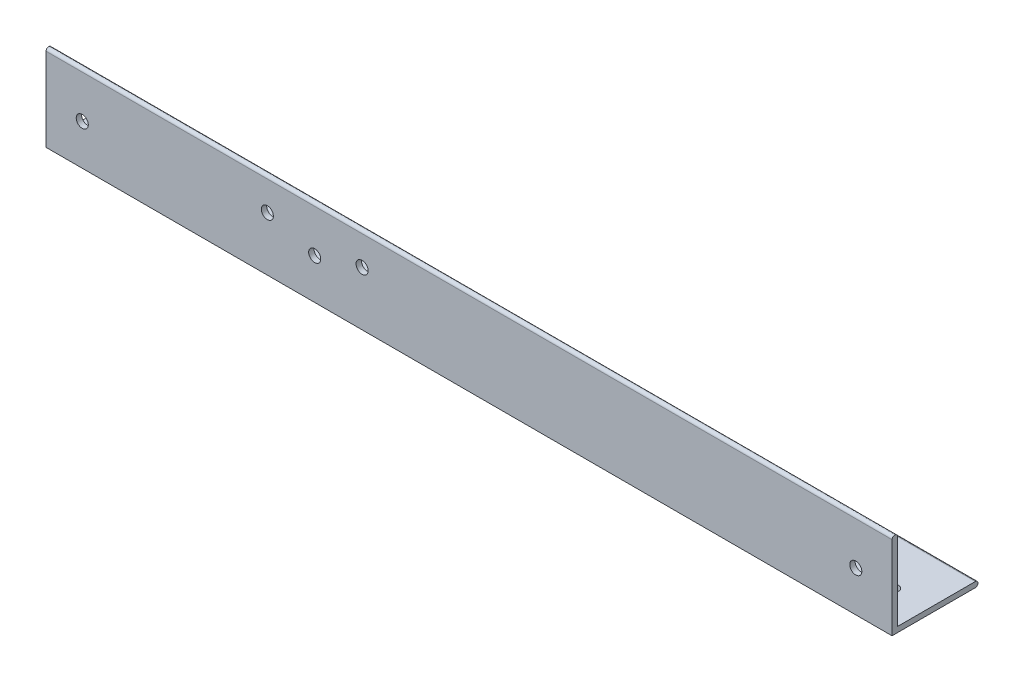
ISO-10303-21;
HEADER;
FILE_DESCRIPTION(('STEP AP214'),'2;1');
FILE_NAME('part.step','',(''),(''),'','','');
FILE_SCHEMA(('AUTOMOTIVE_DESIGN { 1 0 10303 214 1 1 1 1 }'));
ENDSEC;
DATA;
#1=APPLICATION_CONTEXT('core data for automotive mechanical design processes');
#2=APPLICATION_PROTOCOL_DEFINITION('international standard','automotive_design',2000,#1);
#3=PRODUCT_CONTEXT('',#1,'mechanical');
#4=PRODUCT('Part','Part','',(#3));
#5=PRODUCT_RELATED_PRODUCT_CATEGORY('part','',(#4));
#6=PRODUCT_DEFINITION_FORMATION('','',#4);
#7=PRODUCT_DEFINITION_CONTEXT('part definition',#1,'design');
#8=PRODUCT_DEFINITION('design','',#6,#7);
#9=PRODUCT_DEFINITION_SHAPE('','',#8);
#10=(LENGTH_UNIT() NAMED_UNIT(*) SI_UNIT(.MILLI.,.METRE.));
#11=(NAMED_UNIT(*) PLANE_ANGLE_UNIT() SI_UNIT($,.RADIAN.));
#12=(NAMED_UNIT(*) SI_UNIT($,.STERADIAN.) SOLID_ANGLE_UNIT());
#13=UNCERTAINTY_MEASURE_WITH_UNIT(LENGTH_MEASURE(1.E-05),#10,'distance_accuracy_value','');
#14=(GEOMETRIC_REPRESENTATION_CONTEXT(3) GLOBAL_UNCERTAINTY_ASSIGNED_CONTEXT((#13)) GLOBAL_UNIT_ASSIGNED_CONTEXT((#10,
#11,#12)) REPRESENTATION_CONTEXT('',''));
#15=CARTESIAN_POINT('',(0.,0.,0.));
#16=DIRECTION('',(0.,0.,1.));
#17=DIRECTION('',(1.,0.,0.));
#18=AXIS2_PLACEMENT_3D('',#15,#16,#17);
#19=CARTESIAN_POINT('',(250.,0.793749999999999,-24.60625));
#20=DIRECTION('',(-1.,0.,0.));
#21=DIRECTION('',(0.,0.,1.));
#22=AXIS2_PLACEMENT_3D('',#19,#20,#21);
#23=CYLINDRICAL_SURFACE('',#22,0.793749999999999);
#24=DIRECTION('',(-1.,0.,0.));
#25=VECTOR('',#24,1.);
#26=CARTESIAN_POINT('',(250.,1.5875,-24.60625));
#27=LINE('',#26,#25);
#28=CARTESIAN_POINT('',(250.,1.5875,-24.60625));
#29=VERTEX_POINT('',#28);
#30=CARTESIAN_POINT('',(0.,1.5875,-24.60625));
#31=VERTEX_POINT('',#30);
#32=EDGE_CURVE('E156',#29,#31,#27,.T.);
#33=ORIENTED_EDGE('',*,*,#32,.F.);
#34=CARTESIAN_POINT('',(250.,0.793749999999999,-24.60625));
#35=DIRECTION('',(-1.,0.,0.));
#36=DIRECTION('',(0.,0.,1.));
#37=AXIS2_PLACEMENT_3D('',#34,#35,#36);
#38=CIRCLE('',#37,0.793749999999999);
#39=CARTESIAN_POINT('',(250.,0.,-24.60625));
#40=VERTEX_POINT('',#39);
#41=EDGE_CURVE('E52',#40,#29,#38,.F.);
#42=ORIENTED_EDGE('',*,*,#41,.F.);
#43=DIRECTION('',(-1.,0.,0.));
#44=VECTOR('',#43,1.);
#45=CARTESIAN_POINT('',(250.,0.,-24.60625));
#46=LINE('',#45,#44);
#47=CARTESIAN_POINT('',(0.,0.,-24.60625));
#48=VERTEX_POINT('',#47);
#49=EDGE_CURVE('E159',#48,#40,#46,.F.);
#50=ORIENTED_EDGE('',*,*,#49,.F.);
#51=CARTESIAN_POINT('',(0.,0.793749999999999,-24.60625));
#52=DIRECTION('',(-1.,0.,0.));
#53=DIRECTION('',(0.,0.,1.));
#54=AXIS2_PLACEMENT_3D('',#51,#52,#53);
#55=CIRCLE('',#54,0.793749999999999);
#56=EDGE_CURVE('E11',#31,#48,#55,.T.);
#57=ORIENTED_EDGE('',*,*,#56,.F.);
#58=EDGE_LOOP('',(#33,#42,#50,#57));
#59=FACE_BOUND('',#58,.T.);
#60=ADVANCED_FACE('F42',(#59),#23,.T.);
#61=CARTESIAN_POINT('',(250.,24.60625,-0.79375));
#62=DIRECTION('',(-1.,0.,0.));
#63=DIRECTION('',(0.,0.,1.));
#64=AXIS2_PLACEMENT_3D('',#61,#62,#63);
#65=CYLINDRICAL_SURFACE('',#64,0.79375);
#66=DIRECTION('',(-1.,0.,0.));
#67=VECTOR('',#66,1.);
#68=CARTESIAN_POINT('',(250.,24.60625,0.));
#69=LINE('',#68,#67);
#70=CARTESIAN_POINT('',(250.,24.60625,0.));
#71=VERTEX_POINT('',#70);
#72=CARTESIAN_POINT('',(0.,24.60625,0.));
#73=VERTEX_POINT('',#72);
#74=EDGE_CURVE('E115',#71,#73,#69,.T.);
#75=ORIENTED_EDGE('',*,*,#74,.F.);
#76=CARTESIAN_POINT('',(250.,24.60625,-0.79375));
#77=DIRECTION('',(-1.,0.,0.));
#78=DIRECTION('',(0.,0.,1.));
#79=AXIS2_PLACEMENT_3D('',#76,#77,#78);
#80=CIRCLE('',#79,0.79375);
#81=CARTESIAN_POINT('',(250.,24.60625,-1.5875));
#82=VERTEX_POINT('',#81);
#83=EDGE_CURVE('E150',#82,#71,#80,.F.);
#84=ORIENTED_EDGE('',*,*,#83,.F.);
#85=DIRECTION('',(-1.,0.,0.));
#86=VECTOR('',#85,1.);
#87=CARTESIAN_POINT('',(250.,24.60625,-1.5875));
#88=LINE('',#87,#86);
#89=CARTESIAN_POINT('',(0.,24.60625,-1.5875));
#90=VERTEX_POINT('',#89);
#91=EDGE_CURVE('E121',#90,#82,#88,.F.);
#92=ORIENTED_EDGE('',*,*,#91,.F.);
#93=CARTESIAN_POINT('',(0.,24.60625,-0.79375));
#94=DIRECTION('',(-1.,0.,0.));
#95=DIRECTION('',(0.,0.,1.));
#96=AXIS2_PLACEMENT_3D('',#93,#94,#95);
#97=CIRCLE('',#96,0.79375);
#98=EDGE_CURVE('E153',#73,#90,#97,.T.);
#99=ORIENTED_EDGE('',*,*,#98,.F.);
#100=EDGE_LOOP('',(#75,#84,#92,#99));
#101=FACE_BOUND('',#100,.T.);
#102=ADVANCED_FACE('F203',(#101),#65,.T.);
#103=CARTESIAN_POINT('',(250.,0.,-25.4));
#104=DIRECTION('',(0.,1.,0.));
#105=DIRECTION('',(0.,0.,1.));
#106=AXIS2_PLACEMENT_3D('',#103,#104,#105);
#107=PLANE('',#106);
#108=CARTESIAN_POINT('',(166.52,0.,-10.7199999999997));
#109=DIRECTION('',(0.,-1.,0.));
#110=DIRECTION('',(1.,0.,0.));
#111=AXIS2_PLACEMENT_3D('',#108,#109,#110);
#112=CIRCLE('',#111,2.38000000000001);
#113=CARTESIAN_POINT('',(168.9,0.,-10.7199999999997));
#114=VERTEX_POINT('',#113);
#115=EDGE_CURVE('E351',#114,#114,#112,.T.);
#116=ORIENTED_EDGE('',*,*,#115,.F.);
#117=EDGE_LOOP('',(#116));
#118=FACE_BOUND('',#117,.T.);
#119=CARTESIAN_POINT('',(239.59,0.,-10.723125));
#120=DIRECTION('',(0.,-1.,0.));
#121=DIRECTION('',(0.,0.,-1.));
#122=AXIS2_PLACEMENT_3D('',#119,#120,#121);
#123=CIRCLE('',#122,1.58749999999999);
#124=CARTESIAN_POINT('',(239.59,0.,-12.310625));
#125=VERTEX_POINT('',#124);
#126=EDGE_CURVE('E168',#125,#125,#123,.T.);
#127=ORIENTED_EDGE('',*,*,#126,.F.);
#128=EDGE_LOOP('',(#127));
#129=FACE_BOUND('',#128,.T.);
#130=CARTESIAN_POINT('',(10.41,0.,-10.723125));
#131=DIRECTION('',(0.,-1.,0.));
#132=DIRECTION('',(0.,0.,1.));
#133=AXIS2_PLACEMENT_3D('',#130,#131,#132);
#134=CIRCLE('',#133,1.58749999999998);
#135=CARTESIAN_POINT('',(10.41,0.,-9.13562500000002));
#136=VERTEX_POINT('',#135);
#137=EDGE_CURVE('E185',#136,#136,#134,.T.);
#138=ORIENTED_EDGE('',*,*,#137,.F.);
#139=EDGE_LOOP('',(#138));
#140=FACE_BOUND('',#139,.T.);
#141=DIRECTION('',(0.,0.,-1.));
#142=VECTOR('',#141,1.);
#143=CARTESIAN_POINT('',(0.,0.,-25.4));
#144=LINE('',#143,#142);
#145=CARTESIAN_POINT('',(0.,0.,0.));
#146=VERTEX_POINT('',#145);
#147=EDGE_CURVE('E129',#146,#48,#144,.T.);
#148=ORIENTED_EDGE('',*,*,#147,.T.);
#149=ORIENTED_EDGE('',*,*,#49,.T.);
#150=DIRECTION('',(0.,0.,-1.));
#151=VECTOR('',#150,1.);
#152=CARTESIAN_POINT('',(250.,0.,-25.4));
#153=LINE('',#152,#151);
#154=CARTESIAN_POINT('',(250.,0.,0.));
#155=VERTEX_POINT('',#154);
#156=EDGE_CURVE('E105',#155,#40,#153,.T.);
#157=ORIENTED_EDGE('',*,*,#156,.F.);
#158=DIRECTION('',(-1.,0.,0.));
#159=VECTOR('',#158,1.);
#160=CARTESIAN_POINT('',(250.,0.,0.));
#161=LINE('',#160,#159);
#162=EDGE_CURVE('E116',#155,#146,#161,.T.);
#163=ORIENTED_EDGE('',*,*,#162,.T.);
#164=EDGE_LOOP('',(#148,#149,#157,#163));
#165=FACE_BOUND('',#164,.T.);
#166=ADVANCED_FACE('F198',(#118,#129,#140,#165),#107,.F.);
#167=CARTESIAN_POINT('',(250.,1.5875,-1.5875));
#168=DIRECTION('',(0.,-1.,0.));
#169=DIRECTION('',(0.,0.,-1.));
#170=AXIS2_PLACEMENT_3D('',#167,#168,#169);
#171=PLANE('',#170);
#172=CARTESIAN_POINT('',(166.52,1.5875,-10.7199999999997));
#173=DIRECTION('',(0.,-1.,0.));
#174=DIRECTION('',(0.,0.,-1.));
#175=AXIS2_PLACEMENT_3D('',#172,#173,#174);
#176=CIRCLE('',#175,2.38000000000001);
#177=CARTESIAN_POINT('',(166.52,1.5875,-13.0999999999997));
#178=VERTEX_POINT('',#177);
#179=EDGE_CURVE('E46',#178,#178,#176,.T.);
#180=ORIENTED_EDGE('',*,*,#179,.T.);
#181=EDGE_LOOP('',(#180));
#182=FACE_BOUND('',#181,.T.);
#183=CARTESIAN_POINT('',(239.59,1.5875,-10.723125));
#184=DIRECTION('',(0.,-1.,0.));
#185=DIRECTION('',(0.,0.,-1.));
#186=AXIS2_PLACEMENT_3D('',#183,#184,#185);
#187=CIRCLE('',#186,1.58749999999999);
#188=CARTESIAN_POINT('',(239.59,1.5875,-12.310625));
#189=VERTEX_POINT('',#188);
#190=EDGE_CURVE('E167',#189,#189,#187,.T.);
#191=ORIENTED_EDGE('',*,*,#190,.T.);
#192=EDGE_LOOP('',(#191));
#193=FACE_BOUND('',#192,.T.);
#194=CARTESIAN_POINT('',(10.41,1.5875,-10.723125));
#195=DIRECTION('',(0.,-1.,0.));
#196=DIRECTION('',(0.,0.,-1.));
#197=AXIS2_PLACEMENT_3D('',#194,#195,#196);
#198=CIRCLE('',#197,1.58749999999998);
#199=CARTESIAN_POINT('',(10.41,1.5875,-12.310625));
#200=VERTEX_POINT('',#199);
#201=EDGE_CURVE('E164',#200,#200,#198,.T.);
#202=ORIENTED_EDGE('',*,*,#201,.T.);
#203=EDGE_LOOP('',(#202));
#204=FACE_BOUND('',#203,.T.);
#205=DIRECTION('',(0.,0.,1.));
#206=VECTOR('',#205,1.);
#207=CARTESIAN_POINT('',(250.,1.5875,-1.5875));
#208=LINE('',#207,#206);
#209=CARTESIAN_POINT('',(250.,1.5875,-1.5875));
#210=VERTEX_POINT('',#209);
#211=EDGE_CURVE('E96',#29,#210,#208,.T.);
#212=ORIENTED_EDGE('',*,*,#211,.F.);
#213=ORIENTED_EDGE('',*,*,#32,.T.);
#214=DIRECTION('',(0.,0.,1.));
#215=VECTOR('',#214,1.);
#216=CARTESIAN_POINT('',(0.,1.5875,-1.5875));
#217=LINE('',#216,#215);
#218=CARTESIAN_POINT('',(0.,1.5875,-1.5875));
#219=VERTEX_POINT('',#218);
#220=EDGE_CURVE('E110',#31,#219,#217,.T.);
#221=ORIENTED_EDGE('',*,*,#220,.T.);
#222=DIRECTION('',(-1.,0.,0.));
#223=VECTOR('',#222,1.);
#224=CARTESIAN_POINT('',(250.,1.5875,-1.5875));
#225=LINE('',#224,#223);
#226=EDGE_CURVE('E108',#210,#219,#225,.T.);
#227=ORIENTED_EDGE('',*,*,#226,.F.);
#228=EDGE_LOOP('',(#212,#213,#221,#227));
#229=FACE_BOUND('',#228,.T.);
#230=ADVANCED_FACE('F109',(#182,#193,#204,#229),#171,.F.);
#231=CARTESIAN_POINT('',(250.,25.4,-1.5875));
#232=DIRECTION('',(0.,0.,1.));
#233=DIRECTION('',(0.,-1.,0.));
#234=AXIS2_PLACEMENT_3D('',#231,#232,#233);
#235=PLANE('',#234);
#236=CARTESIAN_POINT('',(65.4,15.99625,-1.5875));
#237=DIRECTION('',(0.,0.,1.));
#238=DIRECTION('',(0.,-1.,0.));
#239=AXIS2_PLACEMENT_3D('',#236,#237,#238);
#240=CIRCLE('',#239,1.78499999999999);
#241=CARTESIAN_POINT('',(65.4,14.21125,-1.5875));
#242=VERTEX_POINT('',#241);
#243=EDGE_CURVE('E376',#242,#242,#240,.T.);
#244=ORIENTED_EDGE('',*,*,#243,.T.);
#245=EDGE_LOOP('',(#244));
#246=FACE_BOUND('',#245,.T.);
#247=CARTESIAN_POINT('',(79.4,11.99625,-1.5875));
#248=DIRECTION('',(0.,0.,1.));
#249=DIRECTION('',(0.,-1.,0.));
#250=AXIS2_PLACEMENT_3D('',#247,#248,#249);
#251=CIRCLE('',#250,1.78499999999999);
#252=CARTESIAN_POINT('',(79.4,10.21125,-1.5875));
#253=VERTEX_POINT('',#252);
#254=EDGE_CURVE('E372',#253,#253,#251,.T.);
#255=ORIENTED_EDGE('',*,*,#254,.T.);
#256=EDGE_LOOP('',(#255));
#257=FACE_BOUND('',#256,.T.);
#258=CARTESIAN_POINT('',(93.4,15.99625,-1.5875));
#259=DIRECTION('',(0.,0.,1.));
#260=DIRECTION('',(0.,-1.,0.));
#261=AXIS2_PLACEMENT_3D('',#258,#259,#260);
#262=CIRCLE('',#261,1.78499999999999);
#263=CARTESIAN_POINT('',(93.4,14.21125,-1.5875));
#264=VERTEX_POINT('',#263);
#265=EDGE_CURVE('E365',#264,#264,#262,.T.);
#266=ORIENTED_EDGE('',*,*,#265,.T.);
#267=EDGE_LOOP('',(#266));
#268=FACE_BOUND('',#267,.T.);
#269=CARTESIAN_POINT('',(239.286497308104,12.,-1.5875));
#270=DIRECTION('',(0.,0.,1.));
#271=DIRECTION('',(0.,-1.,0.));
#272=AXIS2_PLACEMENT_3D('',#269,#270,#271);
#273=CIRCLE('',#272,1.7859375);
#274=CARTESIAN_POINT('',(239.286497308104,10.2140625,-1.5875));
#275=VERTEX_POINT('',#274);
#276=EDGE_CURVE('E176',#275,#275,#273,.F.);
#277=ORIENTED_EDGE('',*,*,#276,.F.);
#278=EDGE_LOOP('',(#277));
#279=FACE_BOUND('',#278,.T.);
#280=CARTESIAN_POINT('',(10.7135026918963,12.,-1.5875));
#281=DIRECTION('',(0.,0.,1.));
#282=DIRECTION('',(0.,-1.,0.));
#283=AXIS2_PLACEMENT_3D('',#280,#281,#282);
#284=CIRCLE('',#283,1.7859375);
#285=CARTESIAN_POINT('',(10.7135026918963,10.2140625,-1.5875));
#286=VERTEX_POINT('',#285);
#287=EDGE_CURVE('E133',#286,#286,#284,.T.);
#288=ORIENTED_EDGE('',*,*,#287,.T.);
#289=EDGE_LOOP('',(#288));
#290=FACE_BOUND('',#289,.T.);
#291=DIRECTION('',(0.,1.,0.));
#292=VECTOR('',#291,1.);
#293=CARTESIAN_POINT('',(0.,25.4,-1.5875));
#294=LINE('',#293,#292);
#295=EDGE_CURVE('E136',#219,#90,#294,.T.);
#296=ORIENTED_EDGE('',*,*,#295,.T.);
#297=ORIENTED_EDGE('',*,*,#91,.T.);
#298=DIRECTION('',(0.,1.,0.));
#299=VECTOR('',#298,1.);
#300=CARTESIAN_POINT('',(250.,25.4,-1.5875));
#301=LINE('',#300,#299);
#302=EDGE_CURVE('E101',#210,#82,#301,.T.);
#303=ORIENTED_EDGE('',*,*,#302,.F.);
#304=ORIENTED_EDGE('',*,*,#226,.T.);
#305=EDGE_LOOP('',(#296,#297,#303,#304));
#306=FACE_BOUND('',#305,.T.);
#307=ADVANCED_FACE('F119',(#246,#257,#268,#279,#290,#306),#235,.F.);
#308=CARTESIAN_POINT('',(250.,0.,0.));
#309=DIRECTION('',(0.,0.,-1.));
#310=DIRECTION('',(-1.,0.,0.));
#311=AXIS2_PLACEMENT_3D('',#308,#309,#310);
#312=PLANE('',#311);
#313=CARTESIAN_POINT('',(65.4,15.99625,0.));
#314=DIRECTION('',(0.,0.,1.));
#315=DIRECTION('',(1.,0.,0.));
#316=AXIS2_PLACEMENT_3D('',#313,#314,#315);
#317=CIRCLE('',#316,1.78499999999999);
#318=CARTESIAN_POINT('',(67.185,15.99625,0.));
#319=VERTEX_POINT('',#318);
#320=EDGE_CURVE('E361',#319,#319,#317,.T.);
#321=ORIENTED_EDGE('',*,*,#320,.F.);
#322=EDGE_LOOP('',(#321));
#323=FACE_BOUND('',#322,.T.);
#324=CARTESIAN_POINT('',(79.4,11.99625,0.));
#325=DIRECTION('',(0.,0.,1.));
#326=DIRECTION('',(1.,0.,0.));
#327=AXIS2_PLACEMENT_3D('',#324,#325,#326);
#328=CIRCLE('',#327,1.78499999999999);
#329=CARTESIAN_POINT('',(81.185,11.99625,0.));
#330=VERTEX_POINT('',#329);
#331=EDGE_CURVE('E357',#330,#330,#328,.T.);
#332=ORIENTED_EDGE('',*,*,#331,.F.);
#333=EDGE_LOOP('',(#332));
#334=FACE_BOUND('',#333,.T.);
#335=CARTESIAN_POINT('',(93.4,15.99625,0.));
#336=DIRECTION('',(0.,0.,1.));
#337=DIRECTION('',(1.,0.,0.));
#338=AXIS2_PLACEMENT_3D('',#335,#336,#337);
#339=CIRCLE('',#338,1.78499999999999);
#340=CARTESIAN_POINT('',(95.185,15.99625,0.));
#341=VERTEX_POINT('',#340);
#342=EDGE_CURVE('E353',#341,#341,#339,.T.);
#343=ORIENTED_EDGE('',*,*,#342,.F.);
#344=EDGE_LOOP('',(#343));
#345=FACE_BOUND('',#344,.T.);
#346=CARTESIAN_POINT('',(239.286497308104,12.,0.));
#347=DIRECTION('',(0.,0.,-1.));
#348=DIRECTION('',(-1.,0.,0.));
#349=AXIS2_PLACEMENT_3D('',#346,#347,#348);
#350=CIRCLE('',#349,1.7859375);
#351=CARTESIAN_POINT('',(237.500559808104,12.,0.));
#352=VERTEX_POINT('',#351);
#353=EDGE_CURVE('E171',#352,#352,#350,.T.);
#354=ORIENTED_EDGE('',*,*,#353,.T.);
#355=EDGE_LOOP('',(#354));
#356=FACE_BOUND('',#355,.T.);
#357=CARTESIAN_POINT('',(10.7135026918963,12.,0.));
#358=DIRECTION('',(0.,0.,1.));
#359=DIRECTION('',(1.,0.,0.));
#360=AXIS2_PLACEMENT_3D('',#357,#358,#359);
#361=CIRCLE('',#360,1.7859375);
#362=CARTESIAN_POINT('',(12.4994401918963,12.,0.));
#363=VERTEX_POINT('',#362);
#364=EDGE_CURVE('E182',#363,#363,#361,.T.);
#365=ORIENTED_EDGE('',*,*,#364,.F.);
#366=EDGE_LOOP('',(#365));
#367=FACE_BOUND('',#366,.T.);
#368=DIRECTION('',(0.,-1.,0.));
#369=VECTOR('',#368,1.);
#370=CARTESIAN_POINT('',(250.,0.,0.));
#371=LINE('',#370,#369);
#372=EDGE_CURVE('E123',#71,#155,#371,.T.);
#373=ORIENTED_EDGE('',*,*,#372,.F.);
#374=ORIENTED_EDGE('',*,*,#74,.T.);
#375=DIRECTION('',(0.,-1.,0.));
#376=VECTOR('',#375,1.);
#377=CARTESIAN_POINT('',(0.,0.,0.));
#378=LINE('',#377,#376);
#379=EDGE_CURVE('E139',#73,#146,#378,.T.);
#380=ORIENTED_EDGE('',*,*,#379,.T.);
#381=ORIENTED_EDGE('',*,*,#162,.F.);
#382=EDGE_LOOP('',(#373,#374,#380,#381));
#383=FACE_BOUND('',#382,.T.);
#384=ADVANCED_FACE('F205',(#323,#334,#345,#356,#367,#383),#312,.F.);
#385=CARTESIAN_POINT('',(250.,0.,0.));
#386=DIRECTION('',(-1.,0.,0.));
#387=DIRECTION('',(0.,0.,1.));
#388=AXIS2_PLACEMENT_3D('',#385,#386,#387);
#389=PLANE('',#388);
#390=ORIENTED_EDGE('',*,*,#156,.T.);
#391=ORIENTED_EDGE('',*,*,#41,.T.);
#392=ORIENTED_EDGE('',*,*,#211,.T.);
#393=ORIENTED_EDGE('',*,*,#302,.T.);
#394=ORIENTED_EDGE('',*,*,#83,.T.);
#395=ORIENTED_EDGE('',*,*,#372,.T.);
#396=EDGE_LOOP('',(#390,#391,#392,#393,#394,#395));
#397=FACE_BOUND('',#396,.T.);
#398=ADVANCED_FACE('F99',(#397),#389,.F.);
#399=CARTESIAN_POINT('',(0.,0.,0.));
#400=DIRECTION('',(-1.,0.,0.));
#401=DIRECTION('',(0.,0.,1.));
#402=AXIS2_PLACEMENT_3D('',#399,#400,#401);
#403=PLANE('',#402);
#404=ORIENTED_EDGE('',*,*,#220,.F.);
#405=ORIENTED_EDGE('',*,*,#56,.T.);
#406=ORIENTED_EDGE('',*,*,#147,.F.);
#407=ORIENTED_EDGE('',*,*,#379,.F.);
#408=ORIENTED_EDGE('',*,*,#98,.T.);
#409=ORIENTED_EDGE('',*,*,#295,.F.);
#410=EDGE_LOOP('',(#404,#405,#406,#407,#408,#409));
#411=FACE_BOUND('',#410,.T.);
#412=ADVANCED_FACE('F199',(#411),#403,.T.);
#413=CARTESIAN_POINT('',(10.7135026918963,12.,-25.4));
#414=DIRECTION('',(0.,0.,1.));
#415=DIRECTION('',(1.,0.,0.));
#416=AXIS2_PLACEMENT_3D('',#413,#414,#415);
#417=CYLINDRICAL_SURFACE('',#416,1.7859375);
#418=ORIENTED_EDGE('',*,*,#364,.T.);
#419=EDGE_LOOP('',(#418));
#420=FACE_BOUND('',#419,.T.);
#421=ORIENTED_EDGE('',*,*,#287,.F.);
#422=EDGE_LOOP('',(#421));
#423=FACE_BOUND('',#422,.T.);
#424=ADVANCED_FACE('F254',(#420,#423),#417,.F.);
#425=CARTESIAN_POINT('',(239.286497308104,12.,-25.4));
#426=DIRECTION('',(0.,0.,1.));
#427=DIRECTION('',(1.,0.,0.));
#428=AXIS2_PLACEMENT_3D('',#425,#426,#427);
#429=CYLINDRICAL_SURFACE('',#428,1.7859375);
#430=ORIENTED_EDGE('',*,*,#353,.F.);
#431=EDGE_LOOP('',(#430));
#432=FACE_BOUND('',#431,.T.);
#433=ORIENTED_EDGE('',*,*,#276,.T.);
#434=EDGE_LOOP('',(#433));
#435=FACE_BOUND('',#434,.T.);
#436=ADVANCED_FACE('F244',(#432,#435),#429,.F.);
#437=CARTESIAN_POINT('',(10.41,25.4,-10.723125));
#438=DIRECTION('',(0.,-1.,0.));
#439=DIRECTION('',(0.,0.,-1.));
#440=AXIS2_PLACEMENT_3D('',#437,#438,#439);
#441=CYLINDRICAL_SURFACE('',#440,1.58749999999998);
#442=ORIENTED_EDGE('',*,*,#137,.T.);
#443=EDGE_LOOP('',(#442));
#444=FACE_BOUND('',#443,.T.);
#445=ORIENTED_EDGE('',*,*,#201,.F.);
#446=EDGE_LOOP('',(#445));
#447=FACE_BOUND('',#446,.T.);
#448=ADVANCED_FACE('F241',(#444,#447),#441,.F.);
#449=CARTESIAN_POINT('',(239.59,25.4,-10.723125));
#450=DIRECTION('',(0.,-1.,0.));
#451=DIRECTION('',(0.,0.,-1.));
#452=AXIS2_PLACEMENT_3D('',#449,#450,#451);
#453=CYLINDRICAL_SURFACE('',#452,1.58749999999999);
#454=ORIENTED_EDGE('',*,*,#126,.T.);
#455=EDGE_LOOP('',(#454));
#456=FACE_BOUND('',#455,.T.);
#457=ORIENTED_EDGE('',*,*,#190,.F.);
#458=EDGE_LOOP('',(#457));
#459=FACE_BOUND('',#458,.T.);
#460=ADVANCED_FACE('F243',(#456,#459),#453,.F.);
#461=CARTESIAN_POINT('',(93.4,15.99625,-25.4));
#462=DIRECTION('',(0.,0.,1.));
#463=DIRECTION('',(1.,0.,0.));
#464=AXIS2_PLACEMENT_3D('',#461,#462,#463);
#465=CYLINDRICAL_SURFACE('',#464,1.78499999999999);
#466=ORIENTED_EDGE('',*,*,#342,.T.);
#467=EDGE_LOOP('',(#466));
#468=FACE_BOUND('',#467,.T.);
#469=ORIENTED_EDGE('',*,*,#265,.F.);
#470=EDGE_LOOP('',(#469));
#471=FACE_BOUND('',#470,.T.);
#472=ADVANCED_FACE('F251',(#468,#471),#465,.F.);
#473=CARTESIAN_POINT('',(79.4,11.99625,-25.4));
#474=DIRECTION('',(0.,0.,1.));
#475=DIRECTION('',(1.,0.,0.));
#476=AXIS2_PLACEMENT_3D('',#473,#474,#475);
#477=CYLINDRICAL_SURFACE('',#476,1.78499999999999);
#478=ORIENTED_EDGE('',*,*,#331,.T.);
#479=EDGE_LOOP('',(#478));
#480=FACE_BOUND('',#479,.T.);
#481=ORIENTED_EDGE('',*,*,#254,.F.);
#482=EDGE_LOOP('',(#481));
#483=FACE_BOUND('',#482,.T.);
#484=ADVANCED_FACE('F306',(#480,#483),#477,.F.);
#485=CARTESIAN_POINT('',(65.4,15.99625,-25.4));
#486=DIRECTION('',(0.,0.,1.));
#487=DIRECTION('',(1.,0.,0.));
#488=AXIS2_PLACEMENT_3D('',#485,#486,#487);
#489=CYLINDRICAL_SURFACE('',#488,1.78499999999999);
#490=ORIENTED_EDGE('',*,*,#320,.T.);
#491=EDGE_LOOP('',(#490));
#492=FACE_BOUND('',#491,.T.);
#493=ORIENTED_EDGE('',*,*,#243,.F.);
#494=EDGE_LOOP('',(#493));
#495=FACE_BOUND('',#494,.T.);
#496=ADVANCED_FACE('F315',(#492,#495),#489,.F.);
#497=CARTESIAN_POINT('',(166.52,9.99999999999995,-10.7199999999997));
#498=DIRECTION('',(0.,-1.,0.));
#499=DIRECTION('',(1.,0.,0.));
#500=AXIS2_PLACEMENT_3D('',#497,#498,#499);
#501=CYLINDRICAL_SURFACE('',#500,2.38000000000001);
#502=ORIENTED_EDGE('',*,*,#115,.T.);
#503=EDGE_LOOP('',(#502));
#504=FACE_BOUND('',#503,.T.);
#505=ORIENTED_EDGE('',*,*,#179,.F.);
#506=EDGE_LOOP('',(#505));
#507=FACE_BOUND('',#506,.T.);
#508=ADVANCED_FACE('F325',(#504,#507),#501,.F.);
#509=CLOSED_SHELL('',(#60,#102,#166,#230,#307,#384,#398,#412,#424,#436,#448,#460,#472,#484,#496,#508));
#510=MANIFOLD_SOLID_BREP('B2',#509);
#511=ADVANCED_BREP_SHAPE_REPRESENTATION('',(#18,#510),#14);
#512=SHAPE_DEFINITION_REPRESENTATION(#9,#511);
ENDSEC;
END-ISO-10303-21;
